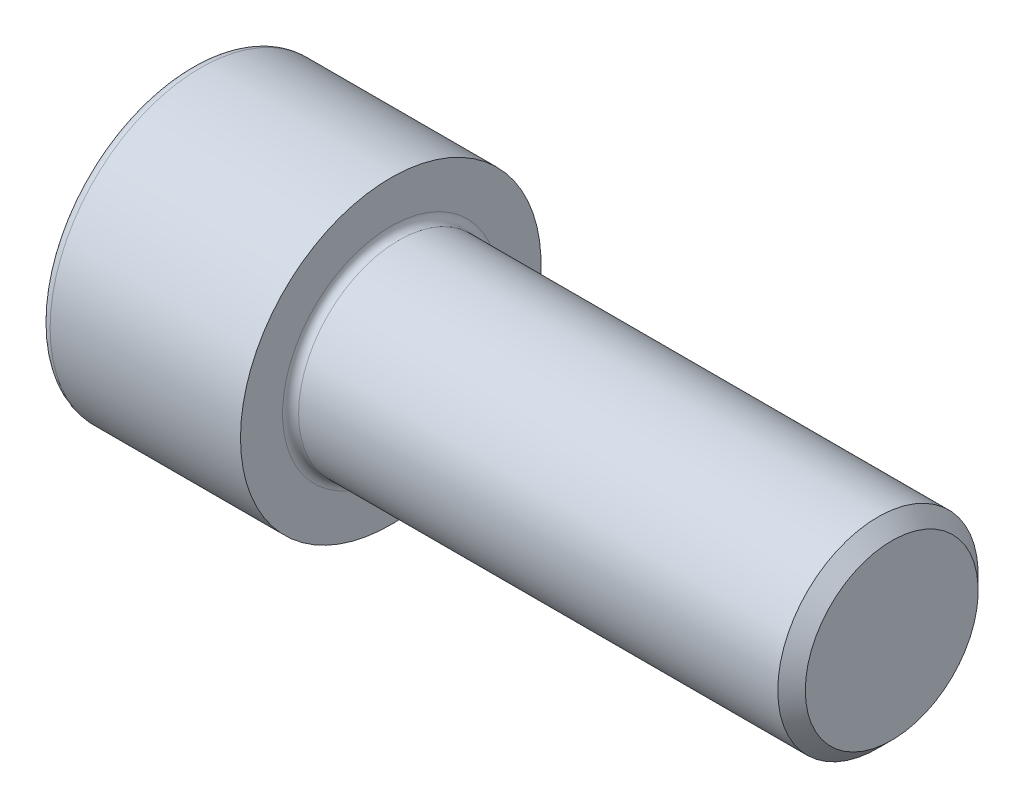
ISO-10303-21;
HEADER;
FILE_DESCRIPTION(('STEP AP214'),'2;1');
FILE_NAME('part.step','',(''),(''),'','','');
FILE_SCHEMA(('AUTOMOTIVE_DESIGN { 1 0 10303 214 1 1 1 1 }'));
ENDSEC;
DATA;
#1=APPLICATION_CONTEXT('core data for automotive mechanical design processes');
#2=APPLICATION_PROTOCOL_DEFINITION('international standard','automotive_design',2000,#1);
#3=PRODUCT_CONTEXT('',#1,'mechanical');
#4=PRODUCT('Part','Part','',(#3));
#5=PRODUCT_RELATED_PRODUCT_CATEGORY('part','',(#4));
#6=PRODUCT_DEFINITION_FORMATION('','',#4);
#7=PRODUCT_DEFINITION_CONTEXT('part definition',#1,'design');
#8=PRODUCT_DEFINITION('design','',#6,#7);
#9=PRODUCT_DEFINITION_SHAPE('','',#8);
#10=(LENGTH_UNIT() NAMED_UNIT(*) SI_UNIT(.MILLI.,.METRE.));
#11=(NAMED_UNIT(*) PLANE_ANGLE_UNIT() SI_UNIT($,.RADIAN.));
#12=(NAMED_UNIT(*) SI_UNIT($,.STERADIAN.) SOLID_ANGLE_UNIT());
#13=UNCERTAINTY_MEASURE_WITH_UNIT(LENGTH_MEASURE(1.E-05),#10,'distance_accuracy_value','');
#14=(GEOMETRIC_REPRESENTATION_CONTEXT(3) GLOBAL_UNCERTAINTY_ASSIGNED_CONTEXT((#13)) GLOBAL_UNIT_ASSIGNED_CONTEXT((#10,
#11,#12)) REPRESENTATION_CONTEXT('',''));
#15=CARTESIAN_POINT('',(0.,0.,0.));
#16=DIRECTION('',(0.,0.,1.));
#17=DIRECTION('',(1.,0.,0.));
#18=AXIS2_PLACEMENT_3D('',#15,#16,#17);
#19=CARTESIAN_POINT('',(0.,0.,0.));
#20=DIRECTION('',(-1.,0.,0.));
#21=DIRECTION('',(0.,0.,1.));
#22=AXIS2_PLACEMENT_3D('',#19,#20,#21);
#23=PLANE('',#22);
#24=DIRECTION('',(0.,-0.499999999999999,0.866025403784439));
#25=VECTOR('',#24,1.);
#26=CARTESIAN_POINT('',(0.,9.94774513813725,0.));
#27=LINE('',#26,#25);
#28=CARTESIAN_POINT('',(0.,9.94774513813725,0.));
#29=VERTEX_POINT('',#28);
#30=CARTESIAN_POINT('',(0.,4.97387256906863,8.61499999999999));
#31=VERTEX_POINT('',#30);
#32=EDGE_CURVE('E258',#29,#31,#27,.T.);
#33=ORIENTED_EDGE('',*,*,#32,.T.);
#34=DIRECTION('',(0.,1.,0.));
#35=VECTOR('',#34,1.);
#36=CARTESIAN_POINT('',(0.,-4.97387256906862,8.615));
#37=LINE('',#36,#35);
#38=CARTESIAN_POINT('',(0.,-4.97387256906862,8.615));
#39=VERTEX_POINT('',#38);
#40=EDGE_CURVE('E130',#39,#31,#37,.T.);
#41=ORIENTED_EDGE('',*,*,#40,.F.);
#42=DIRECTION('',(0.,-0.500000000000001,-0.866025403784438));
#43=VECTOR('',#42,1.);
#44=CARTESIAN_POINT('',(0.,-4.97387256906862,8.615));
#45=LINE('',#44,#43);
#46=CARTESIAN_POINT('',(0.,-9.94774513813725,0.));
#47=VERTEX_POINT('',#46);
#48=EDGE_CURVE('E261',#39,#47,#45,.T.);
#49=ORIENTED_EDGE('',*,*,#48,.T.);
#50=DIRECTION('',(0.,0.499999999999999,-0.866025403784439));
#51=VECTOR('',#50,1.);
#52=CARTESIAN_POINT('',(0.,-9.94774513813725,0.));
#53=LINE('',#52,#51);
#54=CARTESIAN_POINT('',(0.,-4.97387256906864,-8.615));
#55=VERTEX_POINT('',#54);
#56=EDGE_CURVE('E264',#47,#55,#53,.T.);
#57=ORIENTED_EDGE('',*,*,#56,.T.);
#58=DIRECTION('',(0.,-1.,0.));
#59=VECTOR('',#58,1.);
#60=CARTESIAN_POINT('',(0.,4.97387256906861,-8.61500000000001));
#61=LINE('',#60,#59);
#62=CARTESIAN_POINT('',(0.,4.97387256906861,-8.61500000000001));
#63=VERTEX_POINT('',#62);
#64=EDGE_CURVE('E267',#63,#55,#61,.T.);
#65=ORIENTED_EDGE('',*,*,#64,.F.);
#66=DIRECTION('',(0.,-0.500000000000001,-0.866025403784438));
#67=VECTOR('',#66,1.);
#68=CARTESIAN_POINT('',(0.,9.94774513813725,0.));
#69=LINE('',#68,#67);
#70=EDGE_CURVE('E125',#29,#63,#69,.T.);
#71=ORIENTED_EDGE('',*,*,#70,.F.);
#72=EDGE_LOOP('',(#33,#41,#49,#57,#65,#71));
#73=FACE_BOUND('',#72,.T.);
#74=CARTESIAN_POINT('',(0.,0.,0.));
#75=DIRECTION('',(-1.,0.,0.));
#76=DIRECTION('',(0.,0.,1.));
#77=AXIS2_PLACEMENT_3D('',#74,#75,#76);
#78=CIRCLE('',#77,14.);
#79=CARTESIAN_POINT('',(0.,0.,14.));
#80=VERTEX_POINT('',#79);
#81=EDGE_CURVE('E42',#80,#80,#78,.T.);
#82=ORIENTED_EDGE('',*,*,#81,.T.);
#83=EDGE_LOOP('',(#82));
#84=FACE_BOUND('',#83,.T.);
#85=ADVANCED_FACE('F34',(#73,#84),#23,.T.);
#86=CARTESIAN_POINT('',(-31.75,0.,0.));
#87=DIRECTION('',(-1.,0.,0.));
#88=DIRECTION('',(0.,0.,1.));
#89=AXIS2_PLACEMENT_3D('',#86,#87,#88);
#90=CYLINDRICAL_SURFACE('',#89,15.);
#91=CARTESIAN_POINT('',(1.,0.,0.));
#92=DIRECTION('',(-1.,0.,0.));
#93=DIRECTION('',(0.,0.,1.));
#94=AXIS2_PLACEMENT_3D('',#91,#92,#93);
#95=CIRCLE('',#94,15.);
#96=CARTESIAN_POINT('',(1.,0.,15.));
#97=VERTEX_POINT('',#96);
#98=EDGE_CURVE('E11',#97,#97,#95,.F.);
#99=ORIENTED_EDGE('',*,*,#98,.T.);
#100=EDGE_LOOP('',(#99));
#101=FACE_BOUND('',#100,.T.);
#102=CARTESIAN_POINT('',(20.,0.,0.));
#103=DIRECTION('',(-1.,0.,0.));
#104=DIRECTION('',(0.,0.,1.));
#105=AXIS2_PLACEMENT_3D('',#102,#103,#104);
#106=CIRCLE('',#105,15.);
#107=CARTESIAN_POINT('',(20.,0.,15.));
#108=VERTEX_POINT('',#107);
#109=EDGE_CURVE('E148',#108,#108,#106,.T.);
#110=ORIENTED_EDGE('',*,*,#109,.T.);
#111=EDGE_LOOP('',(#110));
#112=FACE_BOUND('',#111,.T.);
#113=ADVANCED_FACE('F172',(#101,#112),#90,.T.);
#114=CARTESIAN_POINT('',(20.,15.,0.));
#115=DIRECTION('',(1.,0.,0.));
#116=DIRECTION('',(0.,0.,-1.));
#117=AXIS2_PLACEMENT_3D('',#114,#115,#116);
#118=PLANE('',#117);
#119=CARTESIAN_POINT('',(20.,0.,0.));
#120=DIRECTION('',(1.,0.,0.));
#121=DIRECTION('',(0.,0.,-1.));
#122=AXIS2_PLACEMENT_3D('',#119,#120,#121);
#123=CIRCLE('',#122,10.7999999999999);
#124=CARTESIAN_POINT('',(20.,0.,-10.7999999999999));
#125=VERTEX_POINT('',#124);
#126=EDGE_CURVE('E151',#125,#125,#123,.F.);
#127=ORIENTED_EDGE('',*,*,#126,.T.);
#128=EDGE_LOOP('',(#127));
#129=FACE_BOUND('',#128,.T.);
#130=ORIENTED_EDGE('',*,*,#109,.F.);
#131=EDGE_LOOP('',(#130));
#132=FACE_BOUND('',#131,.T.);
#133=ADVANCED_FACE('F178',(#129,#132),#118,.T.);
#134=CARTESIAN_POINT('',(-31.75,0.,0.));
#135=DIRECTION('',(-1.,0.,0.));
#136=DIRECTION('',(0.,0.,1.));
#137=AXIS2_PLACEMENT_3D('',#134,#135,#136);
#138=CYLINDRICAL_SURFACE('',#137,9.99999999999993);
#139=CARTESIAN_POINT('',(20.8,0.,0.));
#140=DIRECTION('',(1.,0.,0.));
#141=DIRECTION('',(0.,0.,-1.));
#142=AXIS2_PLACEMENT_3D('',#139,#140,#141);
#143=CIRCLE('',#142,9.99999999999993);
#144=CARTESIAN_POINT('',(20.8,0.,-9.99999999999993));
#145=VERTEX_POINT('',#144);
#146=EDGE_CURVE('E154',#145,#145,#143,.T.);
#147=ORIENTED_EDGE('',*,*,#146,.T.);
#148=EDGE_LOOP('',(#147));
#149=FACE_BOUND('',#148,.T.);
#150=CARTESIAN_POINT('',(68.6259999999999,0.,0.));
#151=DIRECTION('',(-1.,0.,0.));
#152=DIRECTION('',(0.,0.,1.));
#153=AXIS2_PLACEMENT_3D('',#150,#151,#152);
#154=CIRCLE('',#153,9.99999999999985);
#155=CARTESIAN_POINT('',(68.6259999999999,0.,9.99999999999985));
#156=VERTEX_POINT('',#155);
#157=EDGE_CURVE('E145',#156,#156,#154,.T.);
#158=ORIENTED_EDGE('',*,*,#157,.T.);
#159=EDGE_LOOP('',(#158));
#160=FACE_BOUND('',#159,.T.);
#161=ADVANCED_FACE('F184',(#149,#160),#138,.T.);
#162=CARTESIAN_POINT('',(70.,0.,0.));
#163=DIRECTION('',(-1.,0.,0.));
#164=DIRECTION('',(0.,0.,1.));
#165=AXIS2_PLACEMENT_3D('',#162,#163,#164);
#166=CONICAL_SURFACE('',#165,8.626,0.785398163397358);
#167=ORIENTED_EDGE('',*,*,#157,.F.);
#168=EDGE_LOOP('',(#167));
#169=FACE_BOUND('',#168,.T.);
#170=CARTESIAN_POINT('',(70.,0.,0.));
#171=DIRECTION('',(-1.,0.,0.));
#172=DIRECTION('',(0.,0.,1.));
#173=AXIS2_PLACEMENT_3D('',#170,#171,#172);
#174=CIRCLE('',#173,8.626);
#175=CARTESIAN_POINT('',(70.,0.,8.626));
#176=VERTEX_POINT('',#175);
#177=EDGE_CURVE('E141',#176,#176,#174,.T.);
#178=ORIENTED_EDGE('',*,*,#177,.T.);
#179=EDGE_LOOP('',(#178));
#180=FACE_BOUND('',#179,.T.);
#181=ADVANCED_FACE('F188',(#169,#180),#166,.T.);
#182=CARTESIAN_POINT('',(70.,8.626,0.));
#183=DIRECTION('',(1.,0.,0.));
#184=DIRECTION('',(0.,0.,-1.));
#185=AXIS2_PLACEMENT_3D('',#182,#183,#184);
#186=PLANE('',#185);
#187=ORIENTED_EDGE('',*,*,#177,.F.);
#188=EDGE_LOOP('',(#187));
#189=FACE_BOUND('',#188,.T.);
#190=ADVANCED_FACE('F168',(#189),#186,.T.);
#191=CARTESIAN_POINT('',(20.8,0.,0.));
#192=DIRECTION('',(1.,0.,0.));
#193=DIRECTION('',(0.,0.,-1.));
#194=AXIS2_PLACEMENT_3D('',#191,#192,#193);
#195=TOROIDAL_SURFACE('',#194,10.7999999999999,0.8);
#196=ORIENTED_EDGE('',*,*,#146,.F.);
#197=EDGE_LOOP('',(#196));
#198=FACE_BOUND('',#197,.T.);
#199=ORIENTED_EDGE('',*,*,#126,.F.);
#200=EDGE_LOOP('',(#199));
#201=FACE_BOUND('',#200,.T.);
#202=ADVANCED_FACE('F161',(#198,#201),#195,.F.);
#203=CARTESIAN_POINT('',(1.,0.,0.));
#204=DIRECTION('',(-1.,0.,0.));
#205=DIRECTION('',(0.,0.,1.));
#206=AXIS2_PLACEMENT_3D('',#203,#204,#205);
#207=TOROIDAL_SURFACE('',#206,14.,1.);
#208=ORIENTED_EDGE('',*,*,#98,.F.);
#209=EDGE_LOOP('',(#208));
#210=FACE_BOUND('',#209,.T.);
#211=ORIENTED_EDGE('',*,*,#81,.F.);
#212=EDGE_LOOP('',(#211));
#213=FACE_BOUND('',#212,.T.);
#214=ADVANCED_FACE('F36',(#210,#213),#207,.T.);
#215=CARTESIAN_POINT('',(10.,9.94774513813725,0.));
#216=DIRECTION('',(0.,-0.866025403784439,-0.499999999999999));
#217=DIRECTION('',(0.,0.499999999999999,-0.866025403784439));
#218=AXIS2_PLACEMENT_3D('',#215,#216,#217);
#219=PLANE('',#218);
#220=ORIENTED_EDGE('',*,*,#32,.F.);
#221=DIRECTION('',(-1.,0.,0.));
#222=VECTOR('',#221,1.);
#223=CARTESIAN_POINT('',(10.,9.94774513813725,0.));
#224=LINE('',#223,#222);
#225=CARTESIAN_POINT('',(10.,9.94774513813725,0.));
#226=VERTEX_POINT('',#225);
#227=EDGE_CURVE('E248',#226,#29,#224,.T.);
#228=ORIENTED_EDGE('',*,*,#227,.F.);
#229=DIRECTION('',(0.,-0.499999999999999,0.866025403784439));
#230=VECTOR('',#229,1.);
#231=CARTESIAN_POINT('',(10.,9.94774513813725,0.));
#232=LINE('',#231,#230);
#233=CARTESIAN_POINT('',(10.,7.46080885360294,4.30749999999999));
#234=VERTEX_POINT('',#233);
#235=EDGE_CURVE('E117',#226,#234,#232,.T.);
#236=ORIENTED_EDGE('',*,*,#235,.T.);
#237=CARTESIAN_POINT('',(10.,4.97387256906863,8.61499999999999));
#238=VERTEX_POINT('',#237);
#239=EDGE_CURVE('E108',#234,#238,#232,.T.);
#240=ORIENTED_EDGE('',*,*,#239,.T.);
#241=DIRECTION('',(-1.,0.,0.));
#242=VECTOR('',#241,1.);
#243=CARTESIAN_POINT('',(10.,4.97387256906863,8.61499999999999));
#244=LINE('',#243,#242);
#245=EDGE_CURVE('E122',#238,#31,#244,.T.);
#246=ORIENTED_EDGE('',*,*,#245,.T.);
#247=EDGE_LOOP('',(#220,#228,#236,#240,#246));
#248=FACE_BOUND('',#247,.T.);
#249=ADVANCED_FACE('F121',(#248),#219,.T.);
#250=CARTESIAN_POINT('',(10.,-4.97387256906862,8.615));
#251=DIRECTION('',(0.,0.,1.));
#252=DIRECTION('',(0.,-1.,0.));
#253=AXIS2_PLACEMENT_3D('',#250,#251,#252);
#254=PLANE('',#253);
#255=ORIENTED_EDGE('',*,*,#40,.T.);
#256=ORIENTED_EDGE('',*,*,#245,.F.);
#257=DIRECTION('',(0.,1.,0.));
#258=VECTOR('',#257,1.);
#259=CARTESIAN_POINT('',(10.,-4.97387256906862,8.615));
#260=LINE('',#259,#258);
#261=CARTESIAN_POINT('',(10.,0.,8.61499999999999));
#262=VERTEX_POINT('',#261);
#263=EDGE_CURVE('E105',#262,#238,#260,.T.);
#264=ORIENTED_EDGE('',*,*,#263,.F.);
#265=CARTESIAN_POINT('',(10.,-4.97387256906862,8.615));
#266=VERTEX_POINT('',#265);
#267=EDGE_CURVE('E116',#266,#262,#260,.T.);
#268=ORIENTED_EDGE('',*,*,#267,.F.);
#269=DIRECTION('',(-1.,0.,0.));
#270=VECTOR('',#269,1.);
#271=CARTESIAN_POINT('',(10.,-4.97387256906862,8.615));
#272=LINE('',#271,#270);
#273=EDGE_CURVE('E132',#266,#39,#272,.T.);
#274=ORIENTED_EDGE('',*,*,#273,.T.);
#275=EDGE_LOOP('',(#255,#256,#264,#268,#274));
#276=FACE_BOUND('',#275,.T.);
#277=ADVANCED_FACE('F127',(#276),#254,.F.);
#278=CARTESIAN_POINT('',(10.,-4.97387256906862,8.615));
#279=DIRECTION('',(0.,0.866025403784438,-0.500000000000001));
#280=DIRECTION('',(0.,0.500000000000001,0.866025403784438));
#281=AXIS2_PLACEMENT_3D('',#278,#279,#280);
#282=PLANE('',#281);
#283=ORIENTED_EDGE('',*,*,#48,.F.);
#284=ORIENTED_EDGE('',*,*,#273,.F.);
#285=DIRECTION('',(0.,-0.500000000000001,-0.866025403784438));
#286=VECTOR('',#285,1.);
#287=CARTESIAN_POINT('',(10.,-4.97387256906862,8.615));
#288=LINE('',#287,#286);
#289=CARTESIAN_POINT('',(10.,-7.46080885360293,4.30750000000001));
#290=VERTEX_POINT('',#289);
#291=EDGE_CURVE('E287',#266,#290,#288,.T.);
#292=ORIENTED_EDGE('',*,*,#291,.T.);
#293=CARTESIAN_POINT('',(10.,-9.94774513813725,0.));
#294=VERTEX_POINT('',#293);
#295=EDGE_CURVE('E276',#290,#294,#288,.T.);
#296=ORIENTED_EDGE('',*,*,#295,.T.);
#297=DIRECTION('',(-1.,0.,0.));
#298=VECTOR('',#297,1.);
#299=CARTESIAN_POINT('',(10.,-9.94774513813725,0.));
#300=LINE('',#299,#298);
#301=EDGE_CURVE('E137',#294,#47,#300,.T.);
#302=ORIENTED_EDGE('',*,*,#301,.T.);
#303=EDGE_LOOP('',(#283,#284,#292,#296,#302));
#304=FACE_BOUND('',#303,.T.);
#305=ADVANCED_FACE('F202',(#304),#282,.T.);
#306=CARTESIAN_POINT('',(10.,-9.94774513813725,0.));
#307=DIRECTION('',(0.,0.866025403784439,0.499999999999999));
#308=DIRECTION('',(0.,-0.499999999999999,0.866025403784439));
#309=AXIS2_PLACEMENT_3D('',#306,#307,#308);
#310=PLANE('',#309);
#311=ORIENTED_EDGE('',*,*,#56,.F.);
#312=ORIENTED_EDGE('',*,*,#301,.F.);
#313=DIRECTION('',(0.,0.499999999999999,-0.866025403784439));
#314=VECTOR('',#313,1.);
#315=CARTESIAN_POINT('',(10.,-9.94774513813725,0.));
#316=LINE('',#315,#314);
#317=CARTESIAN_POINT('',(10.,-7.46080885360295,-4.30749999999999));
#318=VERTEX_POINT('',#317);
#319=EDGE_CURVE('E254',#294,#318,#316,.T.);
#320=ORIENTED_EDGE('',*,*,#319,.T.);
#321=CARTESIAN_POINT('',(10.,-4.97387256906864,-8.615));
#322=VERTEX_POINT('',#321);
#323=EDGE_CURVE('E286',#318,#322,#316,.T.);
#324=ORIENTED_EDGE('',*,*,#323,.T.);
#325=DIRECTION('',(-1.,0.,0.));
#326=VECTOR('',#325,1.);
#327=CARTESIAN_POINT('',(10.,-4.97387256906864,-8.615));
#328=LINE('',#327,#326);
#329=EDGE_CURVE('E247',#322,#55,#328,.T.);
#330=ORIENTED_EDGE('',*,*,#329,.T.);
#331=EDGE_LOOP('',(#311,#312,#320,#324,#330));
#332=FACE_BOUND('',#331,.T.);
#333=ADVANCED_FACE('F205',(#332),#310,.T.);
#334=CARTESIAN_POINT('',(10.,4.97387256906861,-8.61500000000001));
#335=DIRECTION('',(0.,0.,-1.));
#336=DIRECTION('',(0.,1.,0.));
#337=AXIS2_PLACEMENT_3D('',#334,#335,#336);
#338=PLANE('',#337);
#339=ORIENTED_EDGE('',*,*,#64,.T.);
#340=ORIENTED_EDGE('',*,*,#329,.F.);
#341=DIRECTION('',(0.,-1.,0.));
#342=VECTOR('',#341,1.);
#343=CARTESIAN_POINT('',(10.,4.97387256906861,-8.61500000000001));
#344=LINE('',#343,#342);
#345=CARTESIAN_POINT('',(10.,0.,-8.615));
#346=VERTEX_POINT('',#345);
#347=EDGE_CURVE('E251',#346,#322,#344,.T.);
#348=ORIENTED_EDGE('',*,*,#347,.F.);
#349=CARTESIAN_POINT('',(10.,4.97387256906861,-8.61500000000001));
#350=VERTEX_POINT('',#349);
#351=EDGE_CURVE('E49',#350,#346,#344,.T.);
#352=ORIENTED_EDGE('',*,*,#351,.F.);
#353=DIRECTION('',(-1.,0.,0.));
#354=VECTOR('',#353,1.);
#355=CARTESIAN_POINT('',(10.,4.97387256906861,-8.61500000000001));
#356=LINE('',#355,#354);
#357=EDGE_CURVE('E244',#350,#63,#356,.T.);
#358=ORIENTED_EDGE('',*,*,#357,.T.);
#359=EDGE_LOOP('',(#339,#340,#348,#352,#358));
#360=FACE_BOUND('',#359,.T.);
#361=ADVANCED_FACE('F209',(#360),#338,.F.);
#362=CARTESIAN_POINT('',(10.,9.94774513813725,0.));
#363=DIRECTION('',(0.,0.866025403784438,-0.500000000000001));
#364=DIRECTION('',(0.,0.500000000000001,0.866025403784438));
#365=AXIS2_PLACEMENT_3D('',#362,#363,#364);
#366=PLANE('',#365);
#367=ORIENTED_EDGE('',*,*,#70,.T.);
#368=ORIENTED_EDGE('',*,*,#357,.F.);
#369=DIRECTION('',(0.,-0.500000000000001,-0.866025403784438));
#370=VECTOR('',#369,1.);
#371=CARTESIAN_POINT('',(10.,9.94774513813725,0.));
#372=LINE('',#371,#370);
#373=CARTESIAN_POINT('',(10.,7.46080885360293,-4.30750000000001));
#374=VERTEX_POINT('',#373);
#375=EDGE_CURVE('E234',#374,#350,#372,.T.);
#376=ORIENTED_EDGE('',*,*,#375,.F.);
#377=EDGE_CURVE('E240',#226,#374,#372,.T.);
#378=ORIENTED_EDGE('',*,*,#377,.F.);
#379=ORIENTED_EDGE('',*,*,#227,.T.);
#380=EDGE_LOOP('',(#367,#368,#376,#378,#379));
#381=FACE_BOUND('',#380,.T.);
#382=ADVANCED_FACE('F213',(#381),#366,.F.);
#383=CARTESIAN_POINT('',(10.,9.94774513813725,0.));
#384=DIRECTION('',(1.,0.,0.));
#385=DIRECTION('',(0.,0.,-1.));
#386=AXIS2_PLACEMENT_3D('',#383,#384,#385);
#387=PLANE('',#386);
#388=ORIENTED_EDGE('',*,*,#347,.T.);
#389=ORIENTED_EDGE('',*,*,#323,.F.);
#390=CARTESIAN_POINT('',(10.,0.,0.));
#391=DIRECTION('',(-1.,0.,0.));
#392=DIRECTION('',(0.,0.,1.));
#393=AXIS2_PLACEMENT_3D('',#390,#391,#392);
#394=CIRCLE('',#393,8.615);
#395=EDGE_CURVE('E282',#346,#318,#394,.T.);
#396=ORIENTED_EDGE('',*,*,#395,.F.);
#397=EDGE_LOOP('',(#388,#389,#396));
#398=FACE_BOUND('',#397,.T.);
#399=ADVANCED_FACE('F217',(#398),#387,.F.);
#400=ORIENTED_EDGE('',*,*,#319,.F.);
#401=ORIENTED_EDGE('',*,*,#295,.F.);
#402=EDGE_CURVE('E135',#318,#290,#394,.T.);
#403=ORIENTED_EDGE('',*,*,#402,.F.);
#404=EDGE_LOOP('',(#400,#401,#403));
#405=FACE_BOUND('',#404,.T.);
#406=ADVANCED_FACE('F220',(#405),#387,.F.);
#407=ORIENTED_EDGE('',*,*,#291,.F.);
#408=ORIENTED_EDGE('',*,*,#267,.T.);
#409=EDGE_CURVE('E131',#290,#262,#394,.T.);
#410=ORIENTED_EDGE('',*,*,#409,.F.);
#411=EDGE_LOOP('',(#407,#408,#410));
#412=FACE_BOUND('',#411,.T.);
#413=ADVANCED_FACE('F225',(#412),#387,.F.);
#414=ORIENTED_EDGE('',*,*,#263,.T.);
#415=ORIENTED_EDGE('',*,*,#239,.F.);
#416=EDGE_CURVE('E111',#262,#234,#394,.T.);
#417=ORIENTED_EDGE('',*,*,#416,.F.);
#418=EDGE_LOOP('',(#414,#415,#417));
#419=FACE_BOUND('',#418,.T.);
#420=ADVANCED_FACE('F107',(#419),#387,.F.);
#421=ORIENTED_EDGE('',*,*,#235,.F.);
#422=ORIENTED_EDGE('',*,*,#377,.T.);
#423=EDGE_CURVE('E142',#234,#374,#394,.T.);
#424=ORIENTED_EDGE('',*,*,#423,.F.);
#425=EDGE_LOOP('',(#421,#422,#424));
#426=FACE_BOUND('',#425,.T.);
#427=ADVANCED_FACE('F228',(#426),#387,.F.);
#428=ORIENTED_EDGE('',*,*,#375,.T.);
#429=ORIENTED_EDGE('',*,*,#351,.T.);
#430=EDGE_CURVE('E237',#374,#346,#394,.T.);
#431=ORIENTED_EDGE('',*,*,#430,.F.);
#432=EDGE_LOOP('',(#428,#429,#431));
#433=FACE_BOUND('',#432,.T.);
#434=ADVANCED_FACE('F198',(#433),#387,.F.);
#435=CARTESIAN_POINT('',(10.,0.,0.));
#436=DIRECTION('',(-1.,0.,0.));
#437=DIRECTION('',(0.,0.,1.));
#438=AXIS2_PLACEMENT_3D('',#435,#436,#437);
#439=CONICAL_SURFACE('',#438,8.615,1.04719755119659);
#440=CARTESIAN_POINT('',(14.9738725690687,0.,0.));
#441=VERTEX_POINT('',#440);
#442=VERTEX_LOOP('',#441);
#443=FACE_BOUND('',#442,.T.);
#444=ORIENTED_EDGE('',*,*,#416,.T.);
#445=ORIENTED_EDGE('',*,*,#423,.T.);
#446=ORIENTED_EDGE('',*,*,#430,.T.);
#447=ORIENTED_EDGE('',*,*,#395,.T.);
#448=ORIENTED_EDGE('',*,*,#402,.T.);
#449=ORIENTED_EDGE('',*,*,#409,.T.);
#450=EDGE_LOOP('',(#444,#445,#446,#447,#448,#449));
#451=FACE_BOUND('',#450,.T.);
#452=ADVANCED_FACE('F196',(#443,#451),#439,.F.);
#453=CLOSED_SHELL('',(#85,#113,#133,#161,#181,#190,#202,#214,#249,#277,#305,#333,#361,#382,#399,
#406,#413,#420,#427,#434,#452));
#454=MANIFOLD_SOLID_BREP('B2',#453);
#455=ADVANCED_BREP_SHAPE_REPRESENTATION('',(#18,#454),#14);
#456=SHAPE_DEFINITION_REPRESENTATION(#9,#455);
ENDSEC;
END-ISO-10303-21;
